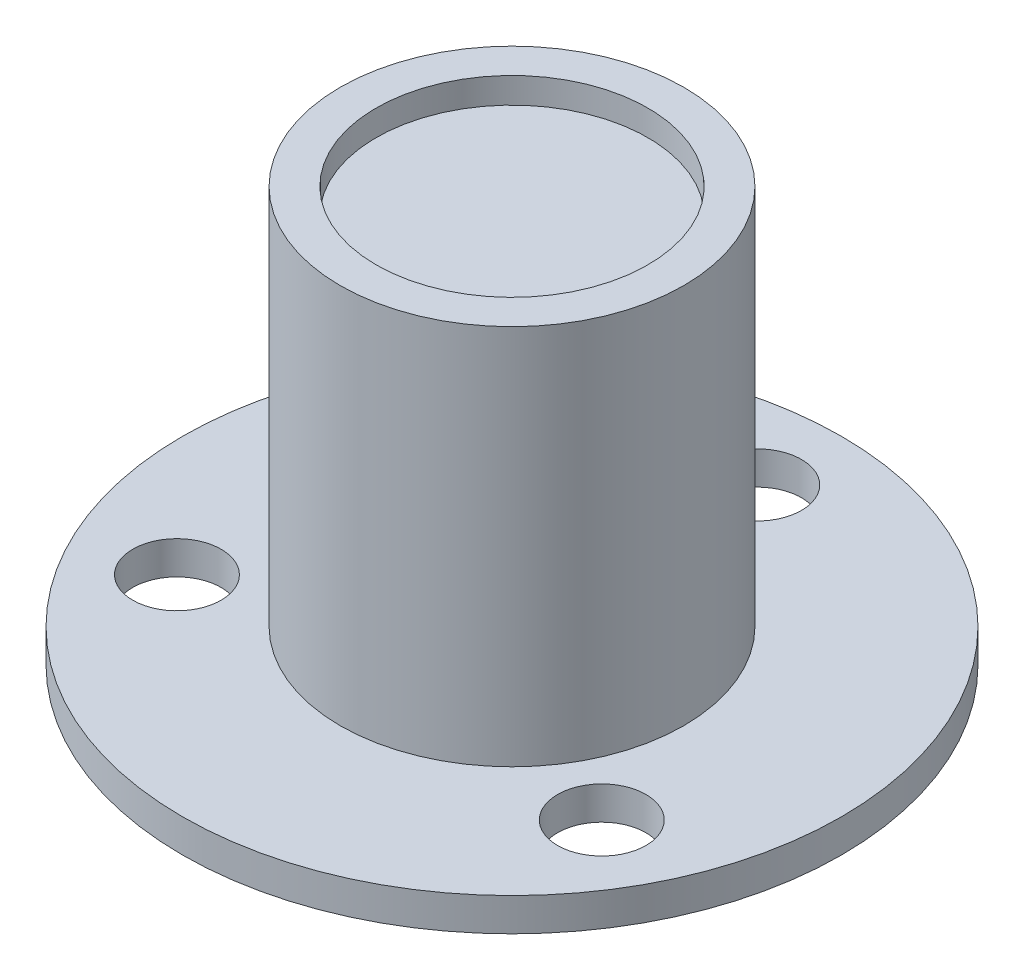
ISO-10303-21;
HEADER;
FILE_DESCRIPTION(('STEP AP214'),'2;1');
FILE_NAME('part.step','',(''),(''),'','','');
FILE_SCHEMA(('AUTOMOTIVE_DESIGN { 1 0 10303 214 1 1 1 1 }'));
ENDSEC;
DATA;
#1=APPLICATION_CONTEXT('core data for automotive mechanical design processes');
#2=APPLICATION_PROTOCOL_DEFINITION('international standard','automotive_design',2000,#1);
#3=PRODUCT_CONTEXT('',#1,'mechanical');
#4=PRODUCT('Part','Part','',(#3));
#5=PRODUCT_RELATED_PRODUCT_CATEGORY('part','',(#4));
#6=PRODUCT_DEFINITION_FORMATION('','',#4);
#7=PRODUCT_DEFINITION_CONTEXT('part definition',#1,'design');
#8=PRODUCT_DEFINITION('design','',#6,#7);
#9=PRODUCT_DEFINITION_SHAPE('','',#8);
#10=(LENGTH_UNIT() NAMED_UNIT(*) SI_UNIT(.MILLI.,.METRE.));
#11=(NAMED_UNIT(*) PLANE_ANGLE_UNIT() SI_UNIT($,.RADIAN.));
#12=(NAMED_UNIT(*) SI_UNIT($,.STERADIAN.) SOLID_ANGLE_UNIT());
#13=UNCERTAINTY_MEASURE_WITH_UNIT(LENGTH_MEASURE(1.E-05),#10,'distance_accuracy_value','');
#14=(GEOMETRIC_REPRESENTATION_CONTEXT(3) GLOBAL_UNCERTAINTY_ASSIGNED_CONTEXT((#13)) GLOBAL_UNIT_ASSIGNED_CONTEXT((#10,
#11,#12)) REPRESENTATION_CONTEXT('',''));
#15=CARTESIAN_POINT('',(0.,0.,0.));
#16=DIRECTION('',(0.,0.,1.));
#17=DIRECTION('',(1.,0.,0.));
#18=AXIS2_PLACEMENT_3D('',#15,#16,#17);
#19=CARTESIAN_POINT('',(0.,15.,0.));
#20=DIRECTION('',(0.,-1.,0.));
#21=DIRECTION('',(0.,0.,-1.));
#22=AXIS2_PLACEMENT_3D('',#19,#20,#21);
#23=CYLINDRICAL_SURFACE('',#22,6.22);
#24=CARTESIAN_POINT('',(0.,15.,0.));
#25=DIRECTION('',(0.,1.,0.));
#26=DIRECTION('',(0.,0.,1.));
#27=AXIS2_PLACEMENT_3D('',#24,#25,#26);
#28=CIRCLE('',#27,6.22);
#29=CARTESIAN_POINT('',(0.,15.,6.22));
#30=VERTEX_POINT('',#29);
#31=EDGE_CURVE('E51',#30,#30,#28,.T.);
#32=ORIENTED_EDGE('',*,*,#31,.F.);
#33=EDGE_LOOP('',(#32));
#34=FACE_BOUND('',#33,.T.);
#35=CARTESIAN_POINT('',(0.,1.2,0.));
#36=DIRECTION('',(0.,-1.,0.));
#37=DIRECTION('',(0.,0.,-1.));
#38=AXIS2_PLACEMENT_3D('',#35,#36,#37);
#39=CIRCLE('',#38,6.22);
#40=CARTESIAN_POINT('',(0.,1.2,-6.22));
#41=VERTEX_POINT('',#40);
#42=EDGE_CURVE('E42',#41,#41,#39,.T.);
#43=ORIENTED_EDGE('',*,*,#42,.F.);
#44=EDGE_LOOP('',(#43));
#45=FACE_BOUND('',#44,.T.);
#46=ADVANCED_FACE('F39',(#34,#45),#23,.T.);
#47=CARTESIAN_POINT('',(0.,15.,0.));
#48=DIRECTION('',(0.,1.,0.));
#49=DIRECTION('',(0.,0.,1.));
#50=AXIS2_PLACEMENT_3D('',#47,#48,#49);
#51=PLANE('',#50);
#52=CARTESIAN_POINT('',(0.,15.,0.));
#53=DIRECTION('',(0.,1.,0.));
#54=DIRECTION('',(0.,0.,1.));
#55=AXIS2_PLACEMENT_3D('',#52,#53,#54);
#56=CIRCLE('',#55,4.92);
#57=CARTESIAN_POINT('',(0.,15.,4.92));
#58=VERTEX_POINT('',#57);
#59=EDGE_CURVE('E63',#58,#58,#56,.T.);
#60=ORIENTED_EDGE('',*,*,#59,.F.);
#61=EDGE_LOOP('',(#60));
#62=FACE_BOUND('',#61,.T.);
#63=ORIENTED_EDGE('',*,*,#31,.T.);
#64=EDGE_LOOP('',(#63));
#65=FACE_BOUND('',#64,.T.);
#66=ADVANCED_FACE('F101',(#62,#65),#51,.T.);
#67=CARTESIAN_POINT('',(0.,1.2,0.));
#68=DIRECTION('',(0.,-1.,0.));
#69=DIRECTION('',(0.,0.,-1.));
#70=AXIS2_PLACEMENT_3D('',#67,#68,#69);
#71=CYLINDRICAL_SURFACE('',#70,11.93);
#72=CARTESIAN_POINT('',(0.,1.2,0.));
#73=DIRECTION('',(0.,-1.,0.));
#74=DIRECTION('',(0.,0.,-1.));
#75=AXIS2_PLACEMENT_3D('',#72,#73,#74);
#76=CIRCLE('',#75,11.93);
#77=CARTESIAN_POINT('',(0.,1.2,-11.93));
#78=VERTEX_POINT('',#77);
#79=EDGE_CURVE('E91',#78,#78,#76,.T.);
#80=ORIENTED_EDGE('',*,*,#79,.T.);
#81=EDGE_LOOP('',(#80));
#82=FACE_BOUND('',#81,.T.);
#83=CARTESIAN_POINT('',(0.,0.,0.));
#84=DIRECTION('',(0.,-1.,0.));
#85=DIRECTION('',(0.,0.,-1.));
#86=AXIS2_PLACEMENT_3D('',#83,#84,#85);
#87=CIRCLE('',#86,11.93);
#88=CARTESIAN_POINT('',(0.,0.,-11.93));
#89=VERTEX_POINT('',#88);
#90=EDGE_CURVE('E80',#89,#89,#87,.T.);
#91=ORIENTED_EDGE('',*,*,#90,.F.);
#92=EDGE_LOOP('',(#91));
#93=FACE_BOUND('',#92,.T.);
#94=ADVANCED_FACE('F111',(#82,#93),#71,.T.);
#95=CARTESIAN_POINT('',(0.,1.2,0.));
#96=DIRECTION('',(0.,-1.,0.));
#97=DIRECTION('',(0.,0.,-1.));
#98=AXIS2_PLACEMENT_3D('',#95,#96,#97);
#99=PLANE('',#98);
#100=CARTESIAN_POINT('',(0.,1.2,-8.88));
#101=DIRECTION('',(0.,1.,0.));
#102=DIRECTION('',(0.,0.,1.));
#103=AXIS2_PLACEMENT_3D('',#100,#101,#102);
#104=CIRCLE('',#103,1.6);
#105=CARTESIAN_POINT('',(0.,1.2,-7.28));
#106=VERTEX_POINT('',#105);
#107=EDGE_CURVE('E72',#106,#106,#104,.T.);
#108=ORIENTED_EDGE('',*,*,#107,.F.);
#109=EDGE_LOOP('',(#108));
#110=FACE_BOUND('',#109,.T.);
#111=CARTESIAN_POINT('',(7.69030558560581,1.2,4.44));
#112=DIRECTION('',(0.,1.,0.));
#113=DIRECTION('',(0.,0.,1.));
#114=AXIS2_PLACEMENT_3D('',#111,#112,#113);
#115=CIRCLE('',#114,1.6);
#116=CARTESIAN_POINT('',(7.69030558560581,1.2,6.04));
#117=VERTEX_POINT('',#116);
#118=EDGE_CURVE('E81',#117,#117,#115,.T.);
#119=ORIENTED_EDGE('',*,*,#118,.F.);
#120=EDGE_LOOP('',(#119));
#121=FACE_BOUND('',#120,.T.);
#122=CARTESIAN_POINT('',(-7.69030558560581,1.2,4.44000000000001));
#123=DIRECTION('',(0.,1.,0.));
#124=DIRECTION('',(0.,0.,1.));
#125=AXIS2_PLACEMENT_3D('',#122,#123,#124);
#126=CIRCLE('',#125,1.6);
#127=CARTESIAN_POINT('',(-7.69030558560581,1.2,6.04000000000001));
#128=VERTEX_POINT('',#127);
#129=EDGE_CURVE('E68',#128,#128,#126,.T.);
#130=ORIENTED_EDGE('',*,*,#129,.F.);
#131=EDGE_LOOP('',(#130));
#132=FACE_BOUND('',#131,.T.);
#133=ORIENTED_EDGE('',*,*,#42,.T.);
#134=EDGE_LOOP('',(#133));
#135=FACE_BOUND('',#134,.T.);
#136=ORIENTED_EDGE('',*,*,#79,.F.);
#137=EDGE_LOOP('',(#136));
#138=FACE_BOUND('',#137,.T.);
#139=ADVANCED_FACE('F107',(#110,#121,#132,#135,#138),#99,.F.);
#140=CARTESIAN_POINT('',(0.,0.,0.));
#141=DIRECTION('',(0.,1.,0.));
#142=DIRECTION('',(0.,0.,1.));
#143=AXIS2_PLACEMENT_3D('',#140,#141,#142);
#144=PLANE('',#143);
#145=CARTESIAN_POINT('',(0.,0.,0.));
#146=DIRECTION('',(0.,-1.,0.));
#147=DIRECTION('',(0.,0.,-1.));
#148=AXIS2_PLACEMENT_3D('',#145,#146,#147);
#149=CIRCLE('',#148,5.445);
#150=CARTESIAN_POINT('',(0.,0.,-5.445));
#151=VERTEX_POINT('',#150);
#152=EDGE_CURVE('E54',#151,#151,#149,.T.);
#153=ORIENTED_EDGE('',*,*,#152,.F.);
#154=EDGE_LOOP('',(#153));
#155=FACE_BOUND('',#154,.T.);
#156=CARTESIAN_POINT('',(0.,0.,-8.88));
#157=DIRECTION('',(0.,1.,0.));
#158=DIRECTION('',(0.,0.,1.));
#159=AXIS2_PLACEMENT_3D('',#156,#157,#158);
#160=CIRCLE('',#159,1.6);
#161=CARTESIAN_POINT('',(0.,0.,-7.28));
#162=VERTEX_POINT('',#161);
#163=EDGE_CURVE('E75',#162,#162,#160,.F.);
#164=ORIENTED_EDGE('',*,*,#163,.F.);
#165=EDGE_LOOP('',(#164));
#166=FACE_BOUND('',#165,.T.);
#167=CARTESIAN_POINT('',(7.69030558560581,0.,4.44));
#168=DIRECTION('',(0.,1.,0.));
#169=DIRECTION('',(0.,0.,1.));
#170=AXIS2_PLACEMENT_3D('',#167,#168,#169);
#171=CIRCLE('',#170,1.6);
#172=CARTESIAN_POINT('',(7.69030558560581,0.,6.04));
#173=VERTEX_POINT('',#172);
#174=EDGE_CURVE('E76',#173,#173,#171,.F.);
#175=ORIENTED_EDGE('',*,*,#174,.F.);
#176=EDGE_LOOP('',(#175));
#177=FACE_BOUND('',#176,.T.);
#178=CARTESIAN_POINT('',(-7.69030558560581,0.,4.44000000000001));
#179=DIRECTION('',(0.,1.,0.));
#180=DIRECTION('',(0.,0.,1.));
#181=AXIS2_PLACEMENT_3D('',#178,#179,#180);
#182=CIRCLE('',#181,1.6);
#183=CARTESIAN_POINT('',(-7.69030558560581,0.,6.04000000000001));
#184=VERTEX_POINT('',#183);
#185=EDGE_CURVE('E84',#184,#184,#182,.F.);
#186=ORIENTED_EDGE('',*,*,#185,.F.);
#187=EDGE_LOOP('',(#186));
#188=FACE_BOUND('',#187,.T.);
#189=ORIENTED_EDGE('',*,*,#90,.T.);
#190=EDGE_LOOP('',(#189));
#191=FACE_BOUND('',#190,.T.);
#192=ADVANCED_FACE('F110',(#155,#166,#177,#188,#191),#144,.F.);
#193=CARTESIAN_POINT('',(-7.69030558560581,-0.000999999999999916,4.44000000000001));
#194=DIRECTION('',(0.,1.,0.));
#195=DIRECTION('',(0.,0.,1.));
#196=AXIS2_PLACEMENT_3D('',#193,#194,#195);
#197=CYLINDRICAL_SURFACE('',#196,1.6);
#198=ORIENTED_EDGE('',*,*,#129,.T.);
#199=EDGE_LOOP('',(#198));
#200=FACE_BOUND('',#199,.T.);
#201=ORIENTED_EDGE('',*,*,#185,.T.);
#202=EDGE_LOOP('',(#201));
#203=FACE_BOUND('',#202,.T.);
#204=ADVANCED_FACE('F122',(#200,#203),#197,.F.);
#205=CARTESIAN_POINT('',(7.69030558560581,-0.000999999999999916,4.44));
#206=DIRECTION('',(0.,1.,0.));
#207=DIRECTION('',(0.,0.,1.));
#208=AXIS2_PLACEMENT_3D('',#205,#206,#207);
#209=CYLINDRICAL_SURFACE('',#208,1.6);
#210=ORIENTED_EDGE('',*,*,#118,.T.);
#211=EDGE_LOOP('',(#210));
#212=FACE_BOUND('',#211,.T.);
#213=ORIENTED_EDGE('',*,*,#174,.T.);
#214=EDGE_LOOP('',(#213));
#215=FACE_BOUND('',#214,.T.);
#216=ADVANCED_FACE('F127',(#212,#215),#209,.F.);
#217=CARTESIAN_POINT('',(0.,-0.000999999999999916,-8.88));
#218=DIRECTION('',(0.,1.,0.));
#219=DIRECTION('',(0.,0.,1.));
#220=AXIS2_PLACEMENT_3D('',#217,#218,#219);
#221=CYLINDRICAL_SURFACE('',#220,1.6);
#222=ORIENTED_EDGE('',*,*,#107,.T.);
#223=EDGE_LOOP('',(#222));
#224=FACE_BOUND('',#223,.T.);
#225=ORIENTED_EDGE('',*,*,#163,.T.);
#226=EDGE_LOOP('',(#225));
#227=FACE_BOUND('',#226,.T.);
#228=ADVANCED_FACE('F138',(#224,#227),#221,.F.);
#229=CARTESIAN_POINT('',(0.,14.07,0.));
#230=DIRECTION('',(0.,1.,0.));
#231=DIRECTION('',(0.,0.,1.));
#232=AXIS2_PLACEMENT_3D('',#229,#230,#231);
#233=CYLINDRICAL_SURFACE('',#232,4.92);
#234=CARTESIAN_POINT('',(0.,14.07,0.));
#235=DIRECTION('',(0.,1.,0.));
#236=DIRECTION('',(0.,0.,1.));
#237=AXIS2_PLACEMENT_3D('',#234,#235,#236);
#238=CIRCLE('',#237,4.92);
#239=CARTESIAN_POINT('',(0.,14.07,4.92));
#240=VERTEX_POINT('',#239);
#241=EDGE_CURVE('E64',#240,#240,#238,.T.);
#242=ORIENTED_EDGE('',*,*,#241,.F.);
#243=EDGE_LOOP('',(#242));
#244=FACE_BOUND('',#243,.T.);
#245=ORIENTED_EDGE('',*,*,#59,.T.);
#246=EDGE_LOOP('',(#245));
#247=FACE_BOUND('',#246,.T.);
#248=ADVANCED_FACE('F142',(#244,#247),#233,.F.);
#249=CARTESIAN_POINT('',(0.,14.07,0.));
#250=DIRECTION('',(0.,1.,0.));
#251=DIRECTION('',(0.,0.,1.));
#252=AXIS2_PLACEMENT_3D('',#249,#250,#251);
#253=PLANE('',#252);
#254=ORIENTED_EDGE('',*,*,#241,.T.);
#255=EDGE_LOOP('',(#254));
#256=FACE_BOUND('',#255,.T.);
#257=ADVANCED_FACE('F146',(#256),#253,.T.);
#258=CARTESIAN_POINT('',(0.,0.25,0.));
#259=DIRECTION('',(0.,-1.,0.));
#260=DIRECTION('',(0.,0.,-1.));
#261=AXIS2_PLACEMENT_3D('',#258,#259,#260);
#262=CYLINDRICAL_SURFACE('',#261,5.445);
#263=CARTESIAN_POINT('',(0.,0.25,0.));
#264=DIRECTION('',(0.,-1.,0.));
#265=DIRECTION('',(0.,0.,-1.));
#266=AXIS2_PLACEMENT_3D('',#263,#264,#265);
#267=CIRCLE('',#266,5.445);
#268=CARTESIAN_POINT('',(0.,0.25,-5.445));
#269=VERTEX_POINT('',#268);
#270=EDGE_CURVE('E60',#269,#269,#267,.T.);
#271=ORIENTED_EDGE('',*,*,#270,.F.);
#272=EDGE_LOOP('',(#271));
#273=FACE_BOUND('',#272,.T.);
#274=ORIENTED_EDGE('',*,*,#152,.T.);
#275=EDGE_LOOP('',(#274));
#276=FACE_BOUND('',#275,.T.);
#277=ADVANCED_FACE('F150',(#273,#276),#262,.F.);
#278=CARTESIAN_POINT('',(0.,0.25,0.));
#279=DIRECTION('',(0.,-1.,0.));
#280=DIRECTION('',(0.,0.,-1.));
#281=AXIS2_PLACEMENT_3D('',#278,#279,#280);
#282=PLANE('',#281);
#283=CARTESIAN_POINT('',(0.,0.25,0.));
#284=DIRECTION('',(0.,-1.,0.));
#285=DIRECTION('',(0.,0.,-1.));
#286=AXIS2_PLACEMENT_3D('',#283,#284,#285);
#287=CIRCLE('',#286,4.875);
#288=CARTESIAN_POINT('',(0.,0.25,-4.875));
#289=VERTEX_POINT('',#288);
#290=EDGE_CURVE('E179',#289,#289,#287,.T.);
#291=ORIENTED_EDGE('',*,*,#290,.F.);
#292=EDGE_LOOP('',(#291));
#293=FACE_BOUND('',#292,.T.);
#294=ORIENTED_EDGE('',*,*,#270,.T.);
#295=EDGE_LOOP('',(#294));
#296=FACE_BOUND('',#295,.T.);
#297=ADVANCED_FACE('F167',(#293,#296),#282,.T.);
#298=CARTESIAN_POINT('',(0.,-2.64,0.));
#299=DIRECTION('',(0.,1.,0.));
#300=DIRECTION('',(0.,0.,1.));
#301=AXIS2_PLACEMENT_3D('',#298,#299,#300);
#302=PLANE('',#301);
#303=CARTESIAN_POINT('',(0.,-2.64,0.));
#304=DIRECTION('',(0.,1.,0.));
#305=DIRECTION('',(0.,0.,1.));
#306=AXIS2_PLACEMENT_3D('',#303,#304,#305);
#307=CIRCLE('',#306,2.425);
#308=CARTESIAN_POINT('',(0.,-2.64,2.425));
#309=VERTEX_POINT('',#308);
#310=EDGE_CURVE('E56',#309,#309,#307,.T.);
#311=ORIENTED_EDGE('',*,*,#310,.F.);
#312=EDGE_LOOP('',(#311));
#313=FACE_BOUND('',#312,.T.);
#314=ADVANCED_FACE('F163',(#313),#302,.F.);
#315=CARTESIAN_POINT('',(0.,-27.1389357775095,0.));
#316=DIRECTION('',(0.,1.,0.));
#317=DIRECTION('',(0.,0.,1.));
#318=AXIS2_PLACEMENT_3D('',#315,#316,#317);
#319=CYLINDRICAL_SURFACE('',#318,2.425);
#320=ORIENTED_EDGE('',*,*,#310,.T.);
#321=EDGE_LOOP('',(#320));
#322=FACE_BOUND('',#321,.T.);
#323=CARTESIAN_POINT('',(0.,-0.76,0.));
#324=DIRECTION('',(0.,-1.,0.));
#325=DIRECTION('',(0.,0.,-1.));
#326=AXIS2_PLACEMENT_3D('',#323,#324,#325);
#327=CIRCLE('',#326,2.425);
#328=CARTESIAN_POINT('',(0.,-0.76,-2.425));
#329=VERTEX_POINT('',#328);
#330=EDGE_CURVE('E11',#329,#329,#327,.T.);
#331=ORIENTED_EDGE('',*,*,#330,.T.);
#332=EDGE_LOOP('',(#331));
#333=FACE_BOUND('',#332,.T.);
#334=ADVANCED_FACE('F159',(#322,#333),#319,.T.);
#335=CARTESIAN_POINT('',(0.,-0.76,0.));
#336=DIRECTION('',(0.,-1.,0.));
#337=DIRECTION('',(0.,0.,-1.));
#338=AXIS2_PLACEMENT_3D('',#335,#336,#337);
#339=PLANE('',#338);
#340=ORIENTED_EDGE('',*,*,#330,.F.);
#341=EDGE_LOOP('',(#340));
#342=FACE_BOUND('',#341,.T.);
#343=CARTESIAN_POINT('',(0.,-0.76,0.));
#344=DIRECTION('',(0.,-1.,0.));
#345=DIRECTION('',(0.,0.,-1.));
#346=AXIS2_PLACEMENT_3D('',#343,#344,#345);
#347=CIRCLE('',#346,4.875);
#348=CARTESIAN_POINT('',(0.,-0.76,-4.875));
#349=VERTEX_POINT('',#348);
#350=EDGE_CURVE('E59',#349,#349,#347,.T.);
#351=ORIENTED_EDGE('',*,*,#350,.T.);
#352=EDGE_LOOP('',(#351));
#353=FACE_BOUND('',#352,.T.);
#354=ADVANCED_FACE('F155',(#342,#353),#339,.T.);
#355=CARTESIAN_POINT('',(0.,-0.76,0.));
#356=DIRECTION('',(0.,1.,0.));
#357=DIRECTION('',(0.,0.,1.));
#358=AXIS2_PLACEMENT_3D('',#355,#356,#357);
#359=CYLINDRICAL_SURFACE('',#358,4.875);
#360=ORIENTED_EDGE('',*,*,#350,.F.);
#361=EDGE_LOOP('',(#360));
#362=FACE_BOUND('',#361,.T.);
#363=ORIENTED_EDGE('',*,*,#290,.T.);
#364=EDGE_LOOP('',(#363));
#365=FACE_BOUND('',#364,.T.);
#366=ADVANCED_FACE('F152',(#362,#365),#359,.T.);
#367=CLOSED_SHELL('',(#46,#66,#94,#139,#192,#204,#216,#228,#248,#257,#277,#297,#314,#334,#354,#366));
#368=MANIFOLD_SOLID_BREP('B2',#367);
#369=ADVANCED_BREP_SHAPE_REPRESENTATION('',(#18,#368),#14);
#370=SHAPE_DEFINITION_REPRESENTATION(#9,#369);
ENDSEC;
END-ISO-10303-21;
